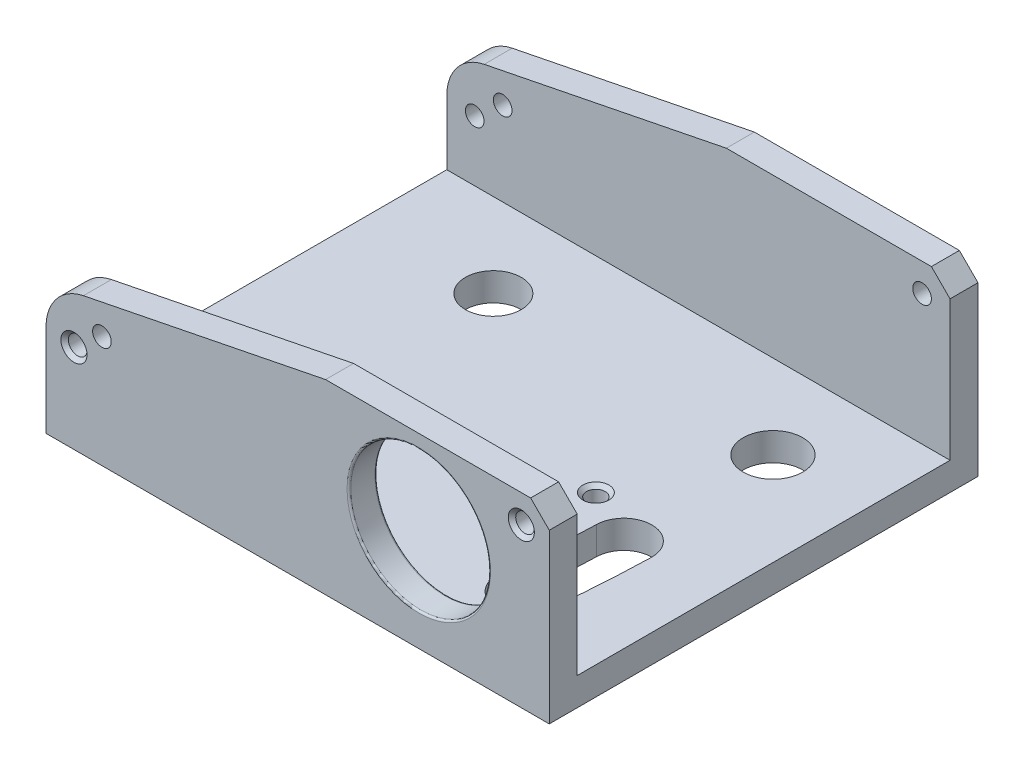
ISO-10303-21;
HEADER;
FILE_DESCRIPTION(('STEP AP214'),'2;1');
FILE_NAME('part.step','',(''),(''),'','','');
FILE_SCHEMA(('AUTOMOTIVE_DESIGN { 1 0 10303 214 1 1 1 1 }'));
ENDSEC;
DATA;
#1=APPLICATION_CONTEXT('core data for automotive mechanical design processes');
#2=APPLICATION_PROTOCOL_DEFINITION('international standard','automotive_design',2000,#1);
#3=PRODUCT_CONTEXT('',#1,'mechanical');
#4=PRODUCT('Part','Part','',(#3));
#5=PRODUCT_RELATED_PRODUCT_CATEGORY('part','',(#4));
#6=PRODUCT_DEFINITION_FORMATION('','',#4);
#7=PRODUCT_DEFINITION_CONTEXT('part definition',#1,'design');
#8=PRODUCT_DEFINITION('design','',#6,#7);
#9=PRODUCT_DEFINITION_SHAPE('','',#8);
#10=(LENGTH_UNIT() NAMED_UNIT(*) SI_UNIT(.MILLI.,.METRE.));
#11=(NAMED_UNIT(*) PLANE_ANGLE_UNIT() SI_UNIT($,.RADIAN.));
#12=(NAMED_UNIT(*) SI_UNIT($,.STERADIAN.) SOLID_ANGLE_UNIT());
#13=UNCERTAINTY_MEASURE_WITH_UNIT(LENGTH_MEASURE(1.E-05),#10,'distance_accuracy_value','');
#14=(GEOMETRIC_REPRESENTATION_CONTEXT(3) GLOBAL_UNCERTAINTY_ASSIGNED_CONTEXT((#13)) GLOBAL_UNIT_ASSIGNED_CONTEXT((#10,
#11,#12)) REPRESENTATION_CONTEXT('',''));
#15=CARTESIAN_POINT('',(0.,0.,0.));
#16=DIRECTION('',(0.,0.,1.));
#17=DIRECTION('',(1.,0.,0.));
#18=AXIS2_PLACEMENT_3D('',#15,#16,#17);
#19=CARTESIAN_POINT('',(-22.,1.5,-6.));
#20=DIRECTION('',(0.,1.,0.));
#21=DIRECTION('',(0.,0.,1.));
#22=AXIS2_PLACEMENT_3D('',#19,#20,#21);
#23=PLANE('',#22);
#24=CARTESIAN_POINT('',(-3.,1.5,6.5));
#25=DIRECTION('',(0.,1.,0.));
#26=DIRECTION('',(0.,0.,1.));
#27=AXIS2_PLACEMENT_3D('',#24,#25,#26);
#28=CIRCLE('',#27,0.700000000000007);
#29=CARTESIAN_POINT('',(-3.,1.5,7.20000000000001));
#30=VERTEX_POINT('',#29);
#31=EDGE_CURVE('E298',#30,#30,#28,.F.);
#32=ORIENTED_EDGE('',*,*,#31,.T.);
#33=EDGE_LOOP('',(#32));
#34=FACE_BOUND('',#33,.T.);
#35=CARTESIAN_POINT('',(-15.,1.5,0.));
#36=DIRECTION('',(0.,1.,0.));
#37=DIRECTION('',(0.,0.,1.));
#38=AXIS2_PLACEMENT_3D('',#35,#36,#37);
#39=CIRCLE('',#38,1.5);
#40=CARTESIAN_POINT('',(-15.,1.5,1.5));
#41=VERTEX_POINT('',#40);
#42=EDGE_CURVE('E384',#41,#41,#39,.T.);
#43=ORIENTED_EDGE('',*,*,#42,.F.);
#44=EDGE_LOOP('',(#43));
#45=FACE_BOUND('',#44,.T.);
#46=CARTESIAN_POINT('',(0.,1.5,0.));
#47=DIRECTION('',(0.,1.,0.));
#48=DIRECTION('',(0.,0.,1.));
#49=AXIS2_PLACEMENT_3D('',#46,#47,#48);
#50=CIRCLE('',#49,1.6);
#51=CARTESIAN_POINT('',(0.,1.5,1.6));
#52=VERTEX_POINT('',#51);
#53=EDGE_CURVE('E347',#52,#52,#50,.T.);
#54=ORIENTED_EDGE('',*,*,#53,.F.);
#55=EDGE_LOOP('',(#54));
#56=FACE_BOUND('',#55,.T.);
#57=CARTESIAN_POINT('',(-70.,1.5,6.));
#58=DIRECTION('',(0.,-1.,0.));
#59=DIRECTION('',(0.,0.,1.));
#60=AXIS2_PLACEMENT_3D('',#57,#58,#59);
#61=CIRCLE('',#60,68.5285656000464);
#62=CARTESIAN_POINT('',(-1.49938812969104,1.5,7.95716033915169));
#63=VERTEX_POINT('',#62);
#64=CARTESIAN_POINT('',(-1.81465725734165,1.5,12.8500611870309));
#65=VERTEX_POINT('',#64);
#66=EDGE_CURVE('E368',#63,#65,#61,.T.);
#67=ORIENTED_EDGE('',*,*,#66,.F.);
#68=CARTESIAN_POINT('',(0.,1.5,8.));
#69=DIRECTION('',(0.,1.,0.));
#70=DIRECTION('',(0.,0.,-1.));
#71=AXIS2_PLACEMENT_3D('',#68,#69,#70);
#72=CIRCLE('',#71,1.5);
#73=CARTESIAN_POINT('',(1.49938812969107,1.5,8.04283966084831));
#74=VERTEX_POINT('',#73);
#75=EDGE_CURVE('E370',#74,#63,#72,.T.);
#76=ORIENTED_EDGE('',*,*,#75,.F.);
#77=CARTESIAN_POINT('',(-70.,1.5,6.));
#78=DIRECTION('',(0.,1.,0.));
#79=DIRECTION('',(0.,0.,1.));
#80=AXIS2_PLACEMENT_3D('',#77,#78,#79);
#81=CIRCLE('',#80,71.5285656000464);
#82=CARTESIAN_POINT('',(1.17031735050041,1.5,13.1499388129691));
#83=VERTEX_POINT('',#82);
#84=EDGE_CURVE('E363',#83,#74,#81,.T.);
#85=ORIENTED_EDGE('',*,*,#84,.F.);
#86=CARTESIAN_POINT('',(-0.322169953420608,1.5,13.));
#87=DIRECTION('',(0.,1.,0.));
#88=DIRECTION('',(0.,0.,-1.));
#89=AXIS2_PLACEMENT_3D('',#86,#87,#88);
#90=CIRCLE('',#89,1.5);
#91=EDGE_CURVE('E365',#65,#83,#90,.T.);
#92=ORIENTED_EDGE('',*,*,#91,.F.);
#93=EDGE_LOOP('',(#67,#76,#85,#92));
#94=FACE_BOUND('',#93,.T.);
#95=DIRECTION('',(0.,0.,-1.));
#96=VECTOR('',#95,1.);
#97=CARTESIAN_POINT('',(5.,1.5,-6.));
#98=LINE('',#97,#96);
#99=CARTESIAN_POINT('',(5.,1.5,15.5));
#100=VERTEX_POINT('',#99);
#101=CARTESIAN_POINT('',(5.,1.5,-4.5));
#102=VERTEX_POINT('',#101);
#103=EDGE_CURVE('E226',#100,#102,#98,.T.);
#104=ORIENTED_EDGE('',*,*,#103,.T.);
#105=DIRECTION('',(-1.,0.,0.));
#106=VECTOR('',#105,1.);
#107=CARTESIAN_POINT('',(5.,1.5,-4.5));
#108=LINE('',#107,#106);
#109=CARTESIAN_POINT('',(-22.,1.5,-4.5));
#110=VERTEX_POINT('',#109);
#111=EDGE_CURVE('E180',#102,#110,#108,.T.);
#112=ORIENTED_EDGE('',*,*,#111,.T.);
#113=DIRECTION('',(0.,0.,1.));
#114=VECTOR('',#113,1.);
#115=CARTESIAN_POINT('',(-22.,1.5,-6.));
#116=LINE('',#115,#114);
#117=CARTESIAN_POINT('',(-22.,1.5,15.5));
#118=VERTEX_POINT('',#117);
#119=EDGE_CURVE('E235',#110,#118,#116,.T.);
#120=ORIENTED_EDGE('',*,*,#119,.T.);
#121=DIRECTION('',(1.,0.,0.));
#122=VECTOR('',#121,1.);
#123=CARTESIAN_POINT('',(-22.,1.5,15.5));
#124=LINE('',#123,#122);
#125=EDGE_CURVE('E221',#118,#100,#124,.T.);
#126=ORIENTED_EDGE('',*,*,#125,.T.);
#127=EDGE_LOOP('',(#104,#112,#120,#126));
#128=FACE_BOUND('',#127,.T.);
#129=ADVANCED_FACE('F30',(#34,#45,#56,#94,#128),#23,.T.);
#130=CARTESIAN_POINT('',(-22.,0.,-6.));
#131=DIRECTION('',(0.,1.,0.));
#132=DIRECTION('',(0.,0.,1.));
#133=AXIS2_PLACEMENT_3D('',#130,#131,#132);
#134=PLANE('',#133);
#135=CARTESIAN_POINT('',(-3.,0.,6.5));
#136=DIRECTION('',(0.,1.,0.));
#137=DIRECTION('',(0.,0.,1.));
#138=AXIS2_PLACEMENT_3D('',#135,#136,#137);
#139=CIRCLE('',#138,0.700000000000011);
#140=CARTESIAN_POINT('',(-3.,0.,7.20000000000001));
#141=VERTEX_POINT('',#140);
#142=EDGE_CURVE('E307',#141,#141,#139,.T.);
#143=ORIENTED_EDGE('',*,*,#142,.T.);
#144=EDGE_LOOP('',(#143));
#145=FACE_BOUND('',#144,.T.);
#146=CARTESIAN_POINT('',(-15.,0.,0.));
#147=DIRECTION('',(0.,1.,0.));
#148=DIRECTION('',(0.,0.,1.));
#149=AXIS2_PLACEMENT_3D('',#146,#147,#148);
#150=CIRCLE('',#149,1.5);
#151=CARTESIAN_POINT('',(-15.,0.,1.5));
#152=VERTEX_POINT('',#151);
#153=EDGE_CURVE('E387',#152,#152,#150,.T.);
#154=ORIENTED_EDGE('',*,*,#153,.T.);
#155=EDGE_LOOP('',(#154));
#156=FACE_BOUND('',#155,.T.);
#157=CARTESIAN_POINT('',(0.,0.,0.));
#158=DIRECTION('',(0.,1.,0.));
#159=DIRECTION('',(0.,0.,1.));
#160=AXIS2_PLACEMENT_3D('',#157,#158,#159);
#161=CIRCLE('',#160,1.6);
#162=CARTESIAN_POINT('',(0.,0.,1.6));
#163=VERTEX_POINT('',#162);
#164=EDGE_CURVE('E350',#163,#163,#161,.T.);
#165=ORIENTED_EDGE('',*,*,#164,.T.);
#166=EDGE_LOOP('',(#165));
#167=FACE_BOUND('',#166,.T.);
#168=DIRECTION('',(0.,0.,1.));
#169=VECTOR('',#168,1.);
#170=CARTESIAN_POINT('',(-22.,0.,-6.));
#171=LINE('',#170,#169);
#172=CARTESIAN_POINT('',(-22.,0.,-6.));
#173=VERTEX_POINT('',#172);
#174=CARTESIAN_POINT('',(-22.,0.,17.));
#175=VERTEX_POINT('',#174);
#176=EDGE_CURVE('E344',#173,#175,#171,.T.);
#177=ORIENTED_EDGE('',*,*,#176,.F.);
#178=DIRECTION('',(-1.,0.,0.));
#179=VECTOR('',#178,1.);
#180=CARTESIAN_POINT('',(-22.,0.,-6.));
#181=LINE('',#180,#179);
#182=CARTESIAN_POINT('',(5.,0.,-6.));
#183=VERTEX_POINT('',#182);
#184=EDGE_CURVE('E337',#183,#173,#181,.T.);
#185=ORIENTED_EDGE('',*,*,#184,.F.);
#186=DIRECTION('',(0.,0.,-1.));
#187=VECTOR('',#186,1.);
#188=CARTESIAN_POINT('',(5.,0.,-6.));
#189=LINE('',#188,#187);
#190=CARTESIAN_POINT('',(5.,0.,17.));
#191=VERTEX_POINT('',#190);
#192=EDGE_CURVE('E340',#191,#183,#189,.T.);
#193=ORIENTED_EDGE('',*,*,#192,.F.);
#194=DIRECTION('',(1.,0.,0.));
#195=VECTOR('',#194,1.);
#196=CARTESIAN_POINT('',(-22.,0.,17.));
#197=LINE('',#196,#195);
#198=EDGE_CURVE('E342',#175,#191,#197,.T.);
#199=ORIENTED_EDGE('',*,*,#198,.F.);
#200=EDGE_LOOP('',(#177,#185,#193,#199));
#201=FACE_BOUND('',#200,.T.);
#202=CARTESIAN_POINT('',(0.,0.,8.));
#203=DIRECTION('',(0.,1.,0.));
#204=DIRECTION('',(0.,0.,-1.));
#205=AXIS2_PLACEMENT_3D('',#202,#203,#204);
#206=CIRCLE('',#205,1.5);
#207=CARTESIAN_POINT('',(1.49938812969107,0.,8.04283966084831));
#208=VERTEX_POINT('',#207);
#209=CARTESIAN_POINT('',(-1.49938812969104,0.,7.95716033915169));
#210=VERTEX_POINT('',#209);
#211=EDGE_CURVE('E381',#208,#210,#206,.T.);
#212=ORIENTED_EDGE('',*,*,#211,.T.);
#213=CARTESIAN_POINT('',(-70.,0.,6.));
#214=DIRECTION('',(0.,-1.,0.));
#215=DIRECTION('',(0.,0.,1.));
#216=AXIS2_PLACEMENT_3D('',#213,#214,#215);
#217=CIRCLE('',#216,68.5285656000464);
#218=CARTESIAN_POINT('',(-1.81465725734165,0.,12.8500611870309));
#219=VERTEX_POINT('',#218);
#220=EDGE_CURVE('E378',#210,#219,#217,.T.);
#221=ORIENTED_EDGE('',*,*,#220,.T.);
#222=CARTESIAN_POINT('',(-0.322169953420608,0.,13.));
#223=DIRECTION('',(0.,1.,0.));
#224=DIRECTION('',(0.,0.,-1.));
#225=AXIS2_PLACEMENT_3D('',#222,#223,#224);
#226=CIRCLE('',#225,1.5);
#227=CARTESIAN_POINT('',(1.17031735050041,0.,13.1499388129691));
#228=VERTEX_POINT('',#227);
#229=EDGE_CURVE('E375',#219,#228,#226,.T.);
#230=ORIENTED_EDGE('',*,*,#229,.T.);
#231=CARTESIAN_POINT('',(-70.,0.,6.));
#232=DIRECTION('',(0.,1.,0.));
#233=DIRECTION('',(0.,0.,1.));
#234=AXIS2_PLACEMENT_3D('',#231,#232,#233);
#235=CIRCLE('',#234,71.5285656000464);
#236=EDGE_CURVE('E372',#228,#208,#235,.T.);
#237=ORIENTED_EDGE('',*,*,#236,.T.);
#238=EDGE_LOOP('',(#212,#221,#230,#237));
#239=FACE_BOUND('',#238,.T.);
#240=ADVANCED_FACE('F421',(#145,#156,#167,#201,#239),#134,.F.);
#241=CARTESIAN_POINT('',(-22.,1.5,-6.));
#242=DIRECTION('',(1.,0.,0.));
#243=DIRECTION('',(0.,0.,-1.));
#244=AXIS2_PLACEMENT_3D('',#241,#242,#243);
#245=PLANE('',#244);
#246=DIRECTION('',(0.,-1.,0.));
#247=VECTOR('',#246,1.);
#248=CARTESIAN_POINT('',(-22.,1.5,17.));
#249=LINE('',#248,#247);
#250=CARTESIAN_POINT('',(-22.,4.95049024320361,17.));
#251=VERTEX_POINT('',#250);
#252=EDGE_CURVE('E320',#251,#175,#249,.T.);
#253=ORIENTED_EDGE('',*,*,#252,.F.);
#254=DIRECTION('',(0.,0.,1.));
#255=VECTOR('',#254,1.);
#256=CARTESIAN_POINT('',(-22.,4.95049024320361,15.5));
#257=LINE('',#256,#255);
#258=CARTESIAN_POINT('',(-22.,4.95049024320361,15.5));
#259=VERTEX_POINT('',#258);
#260=EDGE_CURVE('E246',#251,#259,#257,.F.);
#261=ORIENTED_EDGE('',*,*,#260,.T.);
#262=DIRECTION('',(0.,-1.,0.));
#263=VECTOR('',#262,1.);
#264=CARTESIAN_POINT('',(-22.,7.,15.5));
#265=LINE('',#264,#263);
#266=EDGE_CURVE('E215',#259,#118,#265,.T.);
#267=ORIENTED_EDGE('',*,*,#266,.T.);
#268=ORIENTED_EDGE('',*,*,#119,.F.);
#269=DIRECTION('',(0.,1.,0.));
#270=VECTOR('',#269,1.);
#271=CARTESIAN_POINT('',(-22.,1.5,-4.5));
#272=LINE('',#271,#270);
#273=CARTESIAN_POINT('',(-22.,4.95049024320361,-4.5));
#274=VERTEX_POINT('',#273);
#275=EDGE_CURVE('E182',#110,#274,#272,.T.);
#276=ORIENTED_EDGE('',*,*,#275,.T.);
#277=DIRECTION('',(0.,0.,-1.));
#278=VECTOR('',#277,1.);
#279=CARTESIAN_POINT('',(-22.,4.95049024320361,-6.));
#280=LINE('',#279,#278);
#281=CARTESIAN_POINT('',(-22.,4.95049024320361,-6.));
#282=VERTEX_POINT('',#281);
#283=EDGE_CURVE('E243',#274,#282,#280,.T.);
#284=ORIENTED_EDGE('',*,*,#283,.T.);
#285=DIRECTION('',(0.,-1.,0.));
#286=VECTOR('',#285,1.);
#287=CARTESIAN_POINT('',(-22.,1.5,-6.));
#288=LINE('',#287,#286);
#289=EDGE_CURVE('E333',#282,#173,#288,.T.);
#290=ORIENTED_EDGE('',*,*,#289,.T.);
#291=ORIENTED_EDGE('',*,*,#176,.T.);
#292=EDGE_LOOP('',(#253,#261,#267,#268,#276,#284,#290,#291));
#293=FACE_BOUND('',#292,.T.);
#294=ADVANCED_FACE('F32',(#293),#245,.F.);
#295=CARTESIAN_POINT('',(-22.,1.5,17.));
#296=DIRECTION('',(0.,0.,-1.));
#297=DIRECTION('',(-1.,0.,0.));
#298=AXIS2_PLACEMENT_3D('',#295,#296,#297);
#299=PLANE('',#298);
#300=CARTESIAN_POINT('',(3.5,8.5,17.));
#301=DIRECTION('',(0.,0.,-1.));
#302=DIRECTION('',(-1.,0.,0.));
#303=AXIS2_PLACEMENT_3D('',#300,#301,#302);
#304=CIRCLE('',#303,0.700000000000003);
#305=CARTESIAN_POINT('',(2.8,8.5,17.));
#306=VERTEX_POINT('',#305);
#307=EDGE_CURVE('E275',#306,#306,#304,.T.);
#308=ORIENTED_EDGE('',*,*,#307,.T.);
#309=EDGE_LOOP('',(#308));
#310=FACE_BOUND('',#309,.T.);
#311=CARTESIAN_POINT('',(-20.5,4.75,17.));
#312=DIRECTION('',(0.,0.,-1.));
#313=DIRECTION('',(-1.,0.,0.));
#314=AXIS2_PLACEMENT_3D('',#311,#312,#313);
#315=CIRCLE('',#314,0.700000000000006);
#316=CARTESIAN_POINT('',(-21.2,4.75,17.));
#317=VERTEX_POINT('',#316);
#318=EDGE_CURVE('E280',#317,#317,#315,.T.);
#319=ORIENTED_EDGE('',*,*,#318,.T.);
#320=EDGE_LOOP('',(#319));
#321=FACE_BOUND('',#320,.T.);
#322=CARTESIAN_POINT('',(-2.,5.5,17.));
#323=DIRECTION('',(0.,0.,-1.));
#324=DIRECTION('',(-1.,0.,0.));
#325=AXIS2_PLACEMENT_3D('',#322,#323,#324);
#326=CIRCLE('',#325,3.85);
#327=CARTESIAN_POINT('',(-5.85,5.5,17.));
#328=VERTEX_POINT('',#327);
#329=EDGE_CURVE('E313',#328,#328,#326,.T.);
#330=ORIENTED_EDGE('',*,*,#329,.T.);
#331=EDGE_LOOP('',(#330));
#332=FACE_BOUND('',#331,.T.);
#333=DIRECTION('',(-0.98058067569092,-0.196116135138184,0.));
#334=VECTOR('',#333,1.);
#335=CARTESIAN_POINT('',(-7.,10.,17.));
#336=LINE('',#335,#334);
#337=CARTESIAN_POINT('',(-7.,10.,17.));
#338=VERTEX_POINT('',#337);
#339=CARTESIAN_POINT('',(-19.9902903378455,7.40194193243091,17.));
#340=VERTEX_POINT('',#339);
#341=EDGE_CURVE('E212',#338,#340,#336,.T.);
#342=ORIENTED_EDGE('',*,*,#341,.T.);
#343=CARTESIAN_POINT('',(-19.5,4.95049024320361,17.));
#344=DIRECTION('',(0.,0.,-1.));
#345=DIRECTION('',(-1.,0.,0.));
#346=AXIS2_PLACEMENT_3D('',#343,#344,#345);
#347=CIRCLE('',#346,2.5);
#348=EDGE_CURVE('E241',#340,#251,#347,.F.);
#349=ORIENTED_EDGE('',*,*,#348,.T.);
#350=ORIENTED_EDGE('',*,*,#252,.T.);
#351=ORIENTED_EDGE('',*,*,#198,.T.);
#352=DIRECTION('',(0.,-1.,0.));
#353=VECTOR('',#352,1.);
#354=CARTESIAN_POINT('',(5.,1.5,17.));
#355=LINE('',#354,#353);
#356=CARTESIAN_POINT('',(5.,9.,17.));
#357=VERTEX_POINT('',#356);
#358=EDGE_CURVE('E323',#357,#191,#355,.T.);
#359=ORIENTED_EDGE('',*,*,#358,.F.);
#360=DIRECTION('',(-0.707106781186548,0.707106781186547,0.));
#361=VECTOR('',#360,1.);
#362=CARTESIAN_POINT('',(5.,9.,17.));
#363=LINE('',#362,#361);
#364=CARTESIAN_POINT('',(4.,10.,17.));
#365=VERTEX_POINT('',#364);
#366=EDGE_CURVE('E206',#357,#365,#363,.T.);
#367=ORIENTED_EDGE('',*,*,#366,.T.);
#368=DIRECTION('',(-1.,0.,0.));
#369=VECTOR('',#368,1.);
#370=CARTESIAN_POINT('',(4.,10.,17.));
#371=LINE('',#370,#369);
#372=EDGE_CURVE('E209',#365,#338,#371,.T.);
#373=ORIENTED_EDGE('',*,*,#372,.T.);
#374=EDGE_LOOP('',(#342,#349,#350,#351,#359,#367,#373));
#375=FACE_BOUND('',#374,.T.);
#376=CARTESIAN_POINT('',(-19.,6.,17.));
#377=DIRECTION('',(0.,0.,1.));
#378=DIRECTION('',(1.,0.,0.));
#379=AXIS2_PLACEMENT_3D('',#376,#377,#378);
#380=CIRCLE('',#379,0.499999999999999);
#381=CARTESIAN_POINT('',(-18.5,6.,17.));
#382=VERTEX_POINT('',#381);
#383=EDGE_CURVE('E193',#382,#382,#380,.T.);
#384=ORIENTED_EDGE('',*,*,#383,.F.);
#385=EDGE_LOOP('',(#384));
#386=FACE_BOUND('',#385,.T.);
#387=ADVANCED_FACE('F423',(#310,#321,#332,#375,#386),#299,.F.);
#388=CARTESIAN_POINT('',(5.,1.5,-6.));
#389=DIRECTION('',(-1.,0.,0.));
#390=DIRECTION('',(0.,0.,1.));
#391=AXIS2_PLACEMENT_3D('',#388,#389,#390);
#392=PLANE('',#391);
#393=ORIENTED_EDGE('',*,*,#192,.T.);
#394=DIRECTION('',(0.,-1.,0.));
#395=VECTOR('',#394,1.);
#396=CARTESIAN_POINT('',(5.,1.5,-6.));
#397=LINE('',#396,#395);
#398=CARTESIAN_POINT('',(5.,9.,-6.));
#399=VERTEX_POINT('',#398);
#400=EDGE_CURVE('E328',#399,#183,#397,.T.);
#401=ORIENTED_EDGE('',*,*,#400,.F.);
#402=DIRECTION('',(0.,0.,-1.));
#403=VECTOR('',#402,1.);
#404=CARTESIAN_POINT('',(5.,9.,-4.5));
#405=LINE('',#404,#403);
#406=CARTESIAN_POINT('',(5.,9.,-4.5));
#407=VERTEX_POINT('',#406);
#408=EDGE_CURVE('E190',#407,#399,#405,.T.);
#409=ORIENTED_EDGE('',*,*,#408,.F.);
#410=DIRECTION('',(0.,-1.,0.));
#411=VECTOR('',#410,1.);
#412=CARTESIAN_POINT('',(5.,9.,-4.5));
#413=LINE('',#412,#411);
#414=EDGE_CURVE('E174',#407,#102,#413,.T.);
#415=ORIENTED_EDGE('',*,*,#414,.T.);
#416=ORIENTED_EDGE('',*,*,#103,.F.);
#417=DIRECTION('',(0.,1.,0.));
#418=VECTOR('',#417,1.);
#419=CARTESIAN_POINT('',(5.00000000000001,1.5,15.5));
#420=LINE('',#419,#418);
#421=CARTESIAN_POINT('',(5.,9.,15.5));
#422=VERTEX_POINT('',#421);
#423=EDGE_CURVE('E225',#100,#422,#420,.T.);
#424=ORIENTED_EDGE('',*,*,#423,.T.);
#425=DIRECTION('',(0.,0.,1.));
#426=VECTOR('',#425,1.);
#427=CARTESIAN_POINT('',(5.,9.,15.5));
#428=LINE('',#427,#426);
#429=EDGE_CURVE('E269',#422,#357,#428,.T.);
#430=ORIENTED_EDGE('',*,*,#429,.T.);
#431=ORIENTED_EDGE('',*,*,#358,.T.);
#432=EDGE_LOOP('',(#393,#401,#409,#415,#416,#424,#430,#431));
#433=FACE_BOUND('',#432,.T.);
#434=ADVANCED_FACE('F403',(#433),#392,.F.);
#435=CARTESIAN_POINT('',(-22.,1.5,-6.));
#436=DIRECTION('',(0.,0.,1.));
#437=DIRECTION('',(1.,0.,0.));
#438=AXIS2_PLACEMENT_3D('',#435,#436,#437);
#439=PLANE('',#438);
#440=CARTESIAN_POINT('',(-20.5,4.75,-6.));
#441=DIRECTION('',(0.,0.,1.));
#442=DIRECTION('',(1.,0.,0.));
#443=AXIS2_PLACEMENT_3D('',#440,#441,#442);
#444=CIRCLE('',#443,0.699999999999996);
#445=CARTESIAN_POINT('',(-19.8,4.75,-6.));
#446=VERTEX_POINT('',#445);
#447=EDGE_CURVE('E289',#446,#446,#444,.T.);
#448=ORIENTED_EDGE('',*,*,#447,.T.);
#449=EDGE_LOOP('',(#448));
#450=FACE_BOUND('',#449,.T.);
#451=CARTESIAN_POINT('',(3.5,8.5,-6.));
#452=DIRECTION('',(0.,0.,1.));
#453=DIRECTION('',(1.,0.,0.));
#454=AXIS2_PLACEMENT_3D('',#451,#452,#453);
#455=CIRCLE('',#454,0.700000000000006);
#456=CARTESIAN_POINT('',(4.20000000000001,8.5,-6.));
#457=VERTEX_POINT('',#456);
#458=EDGE_CURVE('E292',#457,#457,#455,.T.);
#459=ORIENTED_EDGE('',*,*,#458,.T.);
#460=EDGE_LOOP('',(#459));
#461=FACE_BOUND('',#460,.T.);
#462=ORIENTED_EDGE('',*,*,#289,.F.);
#463=CARTESIAN_POINT('',(-19.5,4.95049024320361,-6.));
#464=DIRECTION('',(0.,0.,1.));
#465=DIRECTION('',(1.,0.,0.));
#466=AXIS2_PLACEMENT_3D('',#463,#464,#465);
#467=CIRCLE('',#466,2.5);
#468=CARTESIAN_POINT('',(-19.9902903378455,7.40194193243091,-6.));
#469=VERTEX_POINT('',#468);
#470=EDGE_CURVE('E52',#282,#469,#467,.F.);
#471=ORIENTED_EDGE('',*,*,#470,.T.);
#472=DIRECTION('',(0.98058067569092,0.196116135138184,0.));
#473=VECTOR('',#472,1.);
#474=CARTESIAN_POINT('',(-22.,7.,-6.));
#475=LINE('',#474,#473);
#476=CARTESIAN_POINT('',(-7.,10.,-6.));
#477=VERTEX_POINT('',#476);
#478=EDGE_CURVE('E151',#469,#477,#475,.T.);
#479=ORIENTED_EDGE('',*,*,#478,.T.);
#480=DIRECTION('',(1.,0.,0.));
#481=VECTOR('',#480,1.);
#482=CARTESIAN_POINT('',(-7.,10.,-6.));
#483=LINE('',#482,#481);
#484=CARTESIAN_POINT('',(4.,10.,-6.));
#485=VERTEX_POINT('',#484);
#486=EDGE_CURVE('E157',#477,#485,#483,.T.);
#487=ORIENTED_EDGE('',*,*,#486,.T.);
#488=DIRECTION('',(0.707106781186548,-0.707106781186547,0.));
#489=VECTOR('',#488,1.);
#490=CARTESIAN_POINT('',(4.,10.,-6.));
#491=LINE('',#490,#489);
#492=EDGE_CURVE('E172',#485,#399,#491,.T.);
#493=ORIENTED_EDGE('',*,*,#492,.T.);
#494=ORIENTED_EDGE('',*,*,#400,.T.);
#495=ORIENTED_EDGE('',*,*,#184,.T.);
#496=EDGE_LOOP('',(#462,#471,#479,#487,#493,#494,#495));
#497=FACE_BOUND('',#496,.T.);
#498=CARTESIAN_POINT('',(-19.,6.,-6.));
#499=DIRECTION('',(0.,0.,-1.));
#500=DIRECTION('',(-1.,0.,0.));
#501=AXIS2_PLACEMENT_3D('',#498,#499,#500);
#502=CIRCLE('',#501,0.499999999999999);
#503=CARTESIAN_POINT('',(-19.5,6.,-6.));
#504=VERTEX_POINT('',#503);
#505=EDGE_CURVE('E762',#504,#504,#502,.T.);
#506=ORIENTED_EDGE('',*,*,#505,.F.);
#507=EDGE_LOOP('',(#506));
#508=FACE_BOUND('',#507,.T.);
#509=ADVANCED_FACE('F153',(#450,#461,#497,#508),#439,.F.);
#510=CARTESIAN_POINT('',(0.,1.5,0.));
#511=DIRECTION('',(0.,-1.,0.));
#512=DIRECTION('',(0.,0.,-1.));
#513=AXIS2_PLACEMENT_3D('',#510,#511,#512);
#514=CYLINDRICAL_SURFACE('',#513,1.6);
#515=ORIENTED_EDGE('',*,*,#53,.T.);
#516=EDGE_LOOP('',(#515));
#517=FACE_BOUND('',#516,.T.);
#518=ORIENTED_EDGE('',*,*,#164,.F.);
#519=EDGE_LOOP('',(#518));
#520=FACE_BOUND('',#519,.T.);
#521=ADVANCED_FACE('F453',(#517,#520),#514,.F.);
#522=CARTESIAN_POINT('',(0.,1.5,8.));
#523=DIRECTION('',(0.,-1.,0.));
#524=DIRECTION('',(0.,0.,-1.));
#525=AXIS2_PLACEMENT_3D('',#522,#523,#524);
#526=CYLINDRICAL_SURFACE('',#525,1.5);
#527=ORIENTED_EDGE('',*,*,#211,.F.);
#528=DIRECTION('',(0.,-1.,0.));
#529=VECTOR('',#528,1.);
#530=CARTESIAN_POINT('',(1.49938812969107,1.5,8.04283966084831));
#531=LINE('',#530,#529);
#532=EDGE_CURVE('E360',#74,#208,#531,.T.);
#533=ORIENTED_EDGE('',*,*,#532,.F.);
#534=ORIENTED_EDGE('',*,*,#75,.T.);
#535=DIRECTION('',(0.,-1.,0.));
#536=VECTOR('',#535,1.);
#537=CARTESIAN_POINT('',(-1.49938812969104,1.5,7.95716033915169));
#538=LINE('',#537,#536);
#539=EDGE_CURVE('E353',#63,#210,#538,.T.);
#540=ORIENTED_EDGE('',*,*,#539,.T.);
#541=EDGE_LOOP('',(#527,#533,#534,#540));
#542=FACE_BOUND('',#541,.T.);
#543=ADVANCED_FACE('F517',(#542),#526,.F.);
#544=CARTESIAN_POINT('',(-70.,1.5,6.));
#545=DIRECTION('',(0.,-1.,0.));
#546=DIRECTION('',(0.,0.,-1.));
#547=AXIS2_PLACEMENT_3D('',#544,#545,#546);
#548=CYLINDRICAL_SURFACE('',#547,68.5285656000464);
#549=ORIENTED_EDGE('',*,*,#220,.F.);
#550=ORIENTED_EDGE('',*,*,#539,.F.);
#551=ORIENTED_EDGE('',*,*,#66,.T.);
#552=DIRECTION('',(0.,-1.,0.));
#553=VECTOR('',#552,1.);
#554=CARTESIAN_POINT('',(-1.81465725734165,1.5,12.8500611870309));
#555=LINE('',#554,#553);
#556=EDGE_CURVE('E356',#65,#219,#555,.T.);
#557=ORIENTED_EDGE('',*,*,#556,.T.);
#558=EDGE_LOOP('',(#549,#550,#551,#557));
#559=FACE_BOUND('',#558,.T.);
#560=ADVANCED_FACE('F513',(#559),#548,.T.);
#561=CARTESIAN_POINT('',(-0.322169953420608,1.5,13.));
#562=DIRECTION('',(0.,-1.,0.));
#563=DIRECTION('',(0.,0.,-1.));
#564=AXIS2_PLACEMENT_3D('',#561,#562,#563);
#565=CYLINDRICAL_SURFACE('',#564,1.5);
#566=ORIENTED_EDGE('',*,*,#229,.F.);
#567=ORIENTED_EDGE('',*,*,#556,.F.);
#568=ORIENTED_EDGE('',*,*,#91,.T.);
#569=DIRECTION('',(0.,-1.,0.));
#570=VECTOR('',#569,1.);
#571=CARTESIAN_POINT('',(1.17031735050041,1.5,13.1499388129691));
#572=LINE('',#571,#570);
#573=EDGE_CURVE('E358',#83,#228,#572,.T.);
#574=ORIENTED_EDGE('',*,*,#573,.T.);
#575=EDGE_LOOP('',(#566,#567,#568,#574));
#576=FACE_BOUND('',#575,.T.);
#577=ADVANCED_FACE('F509',(#576),#565,.F.);
#578=CARTESIAN_POINT('',(-70.,1.5,6.));
#579=DIRECTION('',(0.,-1.,0.));
#580=DIRECTION('',(0.,0.,-1.));
#581=AXIS2_PLACEMENT_3D('',#578,#579,#580);
#582=CYLINDRICAL_SURFACE('',#581,71.5285656000464);
#583=ORIENTED_EDGE('',*,*,#236,.F.);
#584=ORIENTED_EDGE('',*,*,#573,.F.);
#585=ORIENTED_EDGE('',*,*,#84,.T.);
#586=ORIENTED_EDGE('',*,*,#532,.T.);
#587=EDGE_LOOP('',(#583,#584,#585,#586));
#588=FACE_BOUND('',#587,.T.);
#589=ADVANCED_FACE('F505',(#588),#582,.F.);
#590=CARTESIAN_POINT('',(-15.,1.5,0.));
#591=DIRECTION('',(0.,-1.,0.));
#592=DIRECTION('',(0.,0.,-1.));
#593=AXIS2_PLACEMENT_3D('',#590,#591,#592);
#594=CYLINDRICAL_SURFACE('',#593,1.5);
#595=ORIENTED_EDGE('',*,*,#42,.T.);
#596=EDGE_LOOP('',(#595));
#597=FACE_BOUND('',#596,.T.);
#598=ORIENTED_EDGE('',*,*,#153,.F.);
#599=EDGE_LOOP('',(#598));
#600=FACE_BOUND('',#599,.T.);
#601=ADVANCED_FACE('F501',(#597,#600),#594,.F.);
#602=CARTESIAN_POINT('',(-3.,1.5,6.5));
#603=DIRECTION('',(0.,-1.,0.));
#604=DIRECTION('',(0.,0.,-1.));
#605=AXIS2_PLACEMENT_3D('',#602,#603,#604);
#606=CYLINDRICAL_SURFACE('',#605,0.500000000000001);
#607=CARTESIAN_POINT('',(-3.,0.200000000000013,6.5));
#608=DIRECTION('',(0.,1.,0.));
#609=DIRECTION('',(0.,0.,1.));
#610=AXIS2_PLACEMENT_3D('',#607,#608,#609);
#611=CIRCLE('',#610,0.500000000000001);
#612=CARTESIAN_POINT('',(-3.,0.200000000000013,7.));
#613=VERTEX_POINT('',#612);
#614=EDGE_CURVE('E301',#613,#613,#611,.F.);
#615=ORIENTED_EDGE('',*,*,#614,.T.);
#616=EDGE_LOOP('',(#615));
#617=FACE_BOUND('',#616,.T.);
#618=CARTESIAN_POINT('',(-3.,1.3,6.5));
#619=DIRECTION('',(0.,1.,0.));
#620=DIRECTION('',(0.,0.,1.));
#621=AXIS2_PLACEMENT_3D('',#618,#619,#620);
#622=CIRCLE('',#621,0.500000000000001);
#623=CARTESIAN_POINT('',(-3.,1.3,7.));
#624=VERTEX_POINT('',#623);
#625=EDGE_CURVE('E304',#624,#624,#622,.T.);
#626=ORIENTED_EDGE('',*,*,#625,.T.);
#627=EDGE_LOOP('',(#626));
#628=FACE_BOUND('',#627,.T.);
#629=ADVANCED_FACE('F494',(#617,#628),#606,.F.);
#630=CARTESIAN_POINT('',(-7.,10.,15.5));
#631=DIRECTION('',(-0.196116135138184,0.98058067569092,0.));
#632=DIRECTION('',(-0.98058067569092,-0.196116135138184,0.));
#633=AXIS2_PLACEMENT_3D('',#630,#631,#632);
#634=PLANE('',#633);
#635=DIRECTION('',(-0.98058067569092,-0.196116135138184,0.));
#636=VECTOR('',#635,1.);
#637=CARTESIAN_POINT('',(-7.,10.,15.5));
#638=LINE('',#637,#636);
#639=CARTESIAN_POINT('',(-7.,10.,15.5));
#640=VERTEX_POINT('',#639);
#641=CARTESIAN_POINT('',(-19.9902903378455,7.40194193243091,15.5));
#642=VERTEX_POINT('',#641);
#643=EDGE_CURVE('E257',#640,#642,#638,.T.);
#644=ORIENTED_EDGE('',*,*,#643,.T.);
#645=DIRECTION('',(0.,0.,1.));
#646=VECTOR('',#645,1.);
#647=CARTESIAN_POINT('',(-19.9902903378455,7.40194193243091,17.));
#648=LINE('',#647,#646);
#649=EDGE_CURVE('E266',#642,#340,#648,.T.);
#650=ORIENTED_EDGE('',*,*,#649,.T.);
#651=ORIENTED_EDGE('',*,*,#341,.F.);
#652=DIRECTION('',(0.,0.,1.));
#653=VECTOR('',#652,1.);
#654=CARTESIAN_POINT('',(-7.,10.,15.5));
#655=LINE('',#654,#653);
#656=EDGE_CURVE('E267',#640,#338,#655,.T.);
#657=ORIENTED_EDGE('',*,*,#656,.F.);
#658=EDGE_LOOP('',(#644,#650,#651,#657));
#659=FACE_BOUND('',#658,.T.);
#660=ADVANCED_FACE('F264',(#659),#634,.T.);
#661=CARTESIAN_POINT('',(4.,10.,15.5));
#662=DIRECTION('',(0.,1.,0.));
#663=DIRECTION('',(-1.,0.,0.));
#664=AXIS2_PLACEMENT_3D('',#661,#662,#663);
#665=PLANE('',#664);
#666=ORIENTED_EDGE('',*,*,#372,.F.);
#667=DIRECTION('',(0.,0.,1.));
#668=VECTOR('',#667,1.);
#669=CARTESIAN_POINT('',(4.,10.,15.5));
#670=LINE('',#669,#668);
#671=CARTESIAN_POINT('',(4.,10.,15.5));
#672=VERTEX_POINT('',#671);
#673=EDGE_CURVE('E392',#672,#365,#670,.T.);
#674=ORIENTED_EDGE('',*,*,#673,.F.);
#675=DIRECTION('',(-1.,0.,0.));
#676=VECTOR('',#675,1.);
#677=CARTESIAN_POINT('',(4.,10.,15.5));
#678=LINE('',#677,#676);
#679=EDGE_CURVE('E270',#672,#640,#678,.T.);
#680=ORIENTED_EDGE('',*,*,#679,.T.);
#681=ORIENTED_EDGE('',*,*,#656,.T.);
#682=EDGE_LOOP('',(#666,#674,#680,#681));
#683=FACE_BOUND('',#682,.T.);
#684=ADVANCED_FACE('F493',(#683),#665,.T.);
#685=CARTESIAN_POINT('',(5.,9.,15.5));
#686=DIRECTION('',(0.707106781186547,0.707106781186548,0.));
#687=DIRECTION('',(-0.707106781186548,0.707106781186547,0.));
#688=AXIS2_PLACEMENT_3D('',#685,#686,#687);
#689=PLANE('',#688);
#690=ORIENTED_EDGE('',*,*,#366,.F.);
#691=ORIENTED_EDGE('',*,*,#429,.F.);
#692=DIRECTION('',(-0.707106781186548,0.707106781186547,0.));
#693=VECTOR('',#692,1.);
#694=CARTESIAN_POINT('',(5.,9.,15.5));
#695=LINE('',#694,#693);
#696=EDGE_CURVE('E218',#422,#672,#695,.T.);
#697=ORIENTED_EDGE('',*,*,#696,.T.);
#698=ORIENTED_EDGE('',*,*,#673,.T.);
#699=EDGE_LOOP('',(#690,#691,#697,#698));
#700=FACE_BOUND('',#699,.T.);
#701=ADVANCED_FACE('F399',(#700),#689,.T.);
#702=CARTESIAN_POINT('',(-22.,1.5,15.5));
#703=DIRECTION('',(0.,0.,1.));
#704=DIRECTION('',(1.,0.,0.));
#705=AXIS2_PLACEMENT_3D('',#702,#703,#704);
#706=PLANE('',#705);
#707=CARTESIAN_POINT('',(-2.,5.5,15.5));
#708=DIRECTION('',(0.,0.,1.));
#709=DIRECTION('',(1.,0.,0.));
#710=AXIS2_PLACEMENT_3D('',#707,#708,#709);
#711=CIRCLE('',#710,3.85);
#712=CARTESIAN_POINT('',(1.85,5.5,15.5));
#713=VERTEX_POINT('',#712);
#714=EDGE_CURVE('E310',#713,#713,#711,.T.);
#715=ORIENTED_EDGE('',*,*,#714,.T.);
#716=EDGE_LOOP('',(#715));
#717=FACE_BOUND('',#716,.T.);
#718=CARTESIAN_POINT('',(-19.,6.,15.5));
#719=DIRECTION('',(0.,0.,1.));
#720=DIRECTION('',(1.,0.,0.));
#721=AXIS2_PLACEMENT_3D('',#718,#719,#720);
#722=CIRCLE('',#721,0.499999999999999);
#723=CARTESIAN_POINT('',(-18.5,6.,15.5));
#724=VERTEX_POINT('',#723);
#725=EDGE_CURVE('E197',#724,#724,#722,.T.);
#726=ORIENTED_EDGE('',*,*,#725,.T.);
#727=EDGE_LOOP('',(#726));
#728=FACE_BOUND('',#727,.T.);
#729=CARTESIAN_POINT('',(-20.5,4.75,15.5));
#730=DIRECTION('',(0.,0.,1.));
#731=DIRECTION('',(1.,0.,0.));
#732=AXIS2_PLACEMENT_3D('',#729,#730,#731);
#733=CIRCLE('',#732,0.499999999999999);
#734=CARTESIAN_POINT('',(-20.,4.75,15.5));
#735=VERTEX_POINT('',#734);
#736=EDGE_CURVE('E200',#735,#735,#733,.T.);
#737=ORIENTED_EDGE('',*,*,#736,.T.);
#738=EDGE_LOOP('',(#737));
#739=FACE_BOUND('',#738,.T.);
#740=CARTESIAN_POINT('',(3.5,8.5,15.5));
#741=DIRECTION('',(0.,0.,1.));
#742=DIRECTION('',(1.,0.,0.));
#743=AXIS2_PLACEMENT_3D('',#740,#741,#742);
#744=CIRCLE('',#743,0.500000000000003);
#745=CARTESIAN_POINT('',(4.,8.5,15.5));
#746=VERTEX_POINT('',#745);
#747=EDGE_CURVE('E203',#746,#746,#744,.T.);
#748=ORIENTED_EDGE('',*,*,#747,.T.);
#749=EDGE_LOOP('',(#748));
#750=FACE_BOUND('',#749,.T.);
#751=ORIENTED_EDGE('',*,*,#266,.F.);
#752=CARTESIAN_POINT('',(-19.5,4.95049024320361,15.5));
#753=DIRECTION('',(0.,0.,1.));
#754=DIRECTION('',(1.,0.,0.));
#755=AXIS2_PLACEMENT_3D('',#752,#753,#754);
#756=CIRCLE('',#755,2.5);
#757=EDGE_CURVE('E248',#259,#642,#756,.F.);
#758=ORIENTED_EDGE('',*,*,#757,.T.);
#759=ORIENTED_EDGE('',*,*,#643,.F.);
#760=ORIENTED_EDGE('',*,*,#679,.F.);
#761=ORIENTED_EDGE('',*,*,#696,.F.);
#762=ORIENTED_EDGE('',*,*,#423,.F.);
#763=ORIENTED_EDGE('',*,*,#125,.F.);
#764=EDGE_LOOP('',(#751,#758,#759,#760,#761,#762,#763));
#765=FACE_BOUND('',#764,.T.);
#766=ADVANCED_FACE('F255',(#717,#728,#739,#750,#765),#706,.F.);
#767=CARTESIAN_POINT('',(3.5,8.5,15.5));
#768=DIRECTION('',(0.,0.,1.));
#769=DIRECTION('',(1.,0.,0.));
#770=AXIS2_PLACEMENT_3D('',#767,#768,#769);
#771=CYLINDRICAL_SURFACE('',#770,0.500000000000003);
#772=CARTESIAN_POINT('',(3.5,8.5,16.8));
#773=DIRECTION('',(0.,0.,-1.));
#774=DIRECTION('',(-1.,0.,0.));
#775=AXIS2_PLACEMENT_3D('',#772,#773,#774);
#776=CIRCLE('',#775,0.500000000000003);
#777=CARTESIAN_POINT('',(3.,8.5,16.8));
#778=VERTEX_POINT('',#777);
#779=EDGE_CURVE('E283',#778,#778,#776,.F.);
#780=ORIENTED_EDGE('',*,*,#779,.T.);
#781=EDGE_LOOP('',(#780));
#782=FACE_BOUND('',#781,.T.);
#783=ORIENTED_EDGE('',*,*,#747,.F.);
#784=EDGE_LOOP('',(#783));
#785=FACE_BOUND('',#784,.T.);
#786=ADVANCED_FACE('F477',(#782,#785),#771,.F.);
#787=CARTESIAN_POINT('',(-2.,5.5,15.5));
#788=DIRECTION('',(0.,0.,1.));
#789=DIRECTION('',(1.,0.,0.));
#790=AXIS2_PLACEMENT_3D('',#787,#788,#789);
#791=CYLINDRICAL_SURFACE('',#790,3.75);
#792=CARTESIAN_POINT('',(-2.,5.5,16.9));
#793=DIRECTION('',(0.,0.,-1.));
#794=DIRECTION('',(-1.,0.,0.));
#795=AXIS2_PLACEMENT_3D('',#792,#793,#794);
#796=CIRCLE('',#795,3.75);
#797=CARTESIAN_POINT('',(-5.75,5.5,16.9));
#798=VERTEX_POINT('',#797);
#799=EDGE_CURVE('E316',#798,#798,#796,.F.);
#800=ORIENTED_EDGE('',*,*,#799,.T.);
#801=EDGE_LOOP('',(#800));
#802=FACE_BOUND('',#801,.T.);
#803=CARTESIAN_POINT('',(-2.,5.5,15.6));
#804=DIRECTION('',(0.,0.,1.));
#805=DIRECTION('',(1.,0.,0.));
#806=AXIS2_PLACEMENT_3D('',#803,#804,#805);
#807=CIRCLE('',#806,3.75);
#808=CARTESIAN_POINT('',(1.75,5.5,15.6));
#809=VERTEX_POINT('',#808);
#810=EDGE_CURVE('E318',#809,#809,#807,.F.);
#811=ORIENTED_EDGE('',*,*,#810,.T.);
#812=EDGE_LOOP('',(#811));
#813=FACE_BOUND('',#812,.T.);
#814=ADVANCED_FACE('F475',(#802,#813),#791,.F.);
#815=CARTESIAN_POINT('',(-20.5,4.75,15.5));
#816=DIRECTION('',(0.,0.,1.));
#817=DIRECTION('',(1.,0.,0.));
#818=AXIS2_PLACEMENT_3D('',#815,#816,#817);
#819=CYLINDRICAL_SURFACE('',#818,0.499999999999999);
#820=CARTESIAN_POINT('',(-20.5,4.75,16.8));
#821=DIRECTION('',(0.,0.,-1.));
#822=DIRECTION('',(-1.,0.,0.));
#823=AXIS2_PLACEMENT_3D('',#820,#821,#822);
#824=CIRCLE('',#823,0.499999999999999);
#825=CARTESIAN_POINT('',(-21.,4.75,16.8));
#826=VERTEX_POINT('',#825);
#827=EDGE_CURVE('E273',#826,#826,#824,.F.);
#828=ORIENTED_EDGE('',*,*,#827,.T.);
#829=EDGE_LOOP('',(#828));
#830=FACE_BOUND('',#829,.T.);
#831=ORIENTED_EDGE('',*,*,#736,.F.);
#832=EDGE_LOOP('',(#831));
#833=FACE_BOUND('',#832,.T.);
#834=ADVANCED_FACE('F436',(#830,#833),#819,.F.);
#835=CARTESIAN_POINT('',(-19.,6.,15.5));
#836=DIRECTION('',(0.,0.,1.));
#837=DIRECTION('',(1.,0.,0.));
#838=AXIS2_PLACEMENT_3D('',#835,#836,#837);
#839=CYLINDRICAL_SURFACE('',#838,0.499999999999999);
#840=ORIENTED_EDGE('',*,*,#725,.F.);
#841=EDGE_LOOP('',(#840));
#842=FACE_BOUND('',#841,.T.);
#843=ORIENTED_EDGE('',*,*,#383,.T.);
#844=EDGE_LOOP('',(#843));
#845=FACE_BOUND('',#844,.T.);
#846=ADVANCED_FACE('F429',(#842,#845),#839,.F.);
#847=CARTESIAN_POINT('',(4.,10.,-4.5));
#848=DIRECTION('',(0.707106781186547,0.707106781186548,0.));
#849=DIRECTION('',(-0.707106781186548,0.707106781186547,0.));
#850=AXIS2_PLACEMENT_3D('',#847,#848,#849);
#851=PLANE('',#850);
#852=ORIENTED_EDGE('',*,*,#492,.F.);
#853=DIRECTION('',(0.,0.,-1.));
#854=VECTOR('',#853,1.);
#855=CARTESIAN_POINT('',(4.,10.,-4.5));
#856=LINE('',#855,#854);
#857=CARTESIAN_POINT('',(4.,10.,-4.5));
#858=VERTEX_POINT('',#857);
#859=EDGE_CURVE('E168',#858,#485,#856,.T.);
#860=ORIENTED_EDGE('',*,*,#859,.F.);
#861=DIRECTION('',(0.707106781186548,-0.707106781186547,0.));
#862=VECTOR('',#861,1.);
#863=CARTESIAN_POINT('',(4.,10.,-4.5));
#864=LINE('',#863,#862);
#865=EDGE_CURVE('E169',#858,#407,#864,.T.);
#866=ORIENTED_EDGE('',*,*,#865,.T.);
#867=ORIENTED_EDGE('',*,*,#408,.T.);
#868=EDGE_LOOP('',(#852,#860,#866,#867));
#869=FACE_BOUND('',#868,.T.);
#870=ADVANCED_FACE('F426',(#869),#851,.T.);
#871=CARTESIAN_POINT('',(-7.,10.,-4.5));
#872=DIRECTION('',(0.,1.,0.));
#873=DIRECTION('',(-1.,0.,0.));
#874=AXIS2_PLACEMENT_3D('',#871,#872,#873);
#875=PLANE('',#874);
#876=ORIENTED_EDGE('',*,*,#486,.F.);
#877=DIRECTION('',(0.,0.,-1.));
#878=VECTOR('',#877,1.);
#879=CARTESIAN_POINT('',(-7.,10.,-4.5));
#880=LINE('',#879,#878);
#881=CARTESIAN_POINT('',(-7.,10.,-4.5));
#882=VERTEX_POINT('',#881);
#883=EDGE_CURVE('E162',#882,#477,#880,.T.);
#884=ORIENTED_EDGE('',*,*,#883,.F.);
#885=DIRECTION('',(1.,0.,0.));
#886=VECTOR('',#885,1.);
#887=CARTESIAN_POINT('',(-7.,10.,-4.5));
#888=LINE('',#887,#886);
#889=EDGE_CURVE('E186',#882,#858,#888,.T.);
#890=ORIENTED_EDGE('',*,*,#889,.T.);
#891=ORIENTED_EDGE('',*,*,#859,.T.);
#892=EDGE_LOOP('',(#876,#884,#890,#891));
#893=FACE_BOUND('',#892,.T.);
#894=ADVANCED_FACE('F171',(#893),#875,.T.);
#895=CARTESIAN_POINT('',(-22.,7.,-4.5));
#896=DIRECTION('',(-0.196116135138184,0.98058067569092,0.));
#897=DIRECTION('',(-0.98058067569092,-0.196116135138184,0.));
#898=AXIS2_PLACEMENT_3D('',#895,#896,#897);
#899=PLANE('',#898);
#900=ORIENTED_EDGE('',*,*,#478,.F.);
#901=DIRECTION('',(0.,0.,-1.));
#902=VECTOR('',#901,1.);
#903=CARTESIAN_POINT('',(-19.9902903378455,7.40194193243091,-4.5));
#904=LINE('',#903,#902);
#905=CARTESIAN_POINT('',(-19.9902903378455,7.40194193243091,-4.5));
#906=VERTEX_POINT('',#905);
#907=EDGE_CURVE('E38',#469,#906,#904,.F.);
#908=ORIENTED_EDGE('',*,*,#907,.T.);
#909=DIRECTION('',(0.98058067569092,0.196116135138184,0.));
#910=VECTOR('',#909,1.);
#911=CARTESIAN_POINT('',(-22.,7.,-4.5));
#912=LINE('',#911,#910);
#913=EDGE_CURVE('E164',#906,#882,#912,.T.);
#914=ORIENTED_EDGE('',*,*,#913,.T.);
#915=ORIENTED_EDGE('',*,*,#883,.T.);
#916=EDGE_LOOP('',(#900,#908,#914,#915));
#917=FACE_BOUND('',#916,.T.);
#918=ADVANCED_FACE('F163',(#917),#899,.T.);
#919=CARTESIAN_POINT('',(5.,1.5,-4.5));
#920=DIRECTION('',(0.,0.,-1.));
#921=DIRECTION('',(-1.,0.,0.));
#922=AXIS2_PLACEMENT_3D('',#919,#920,#921);
#923=PLANE('',#922);
#924=CARTESIAN_POINT('',(-19.,6.,-4.5));
#925=DIRECTION('',(0.,0.,-1.));
#926=DIRECTION('',(-1.,0.,0.));
#927=AXIS2_PLACEMENT_3D('',#924,#925,#926);
#928=CIRCLE('',#927,0.499999999999999);
#929=CARTESIAN_POINT('',(-19.5,6.,-4.5));
#930=VERTEX_POINT('',#929);
#931=EDGE_CURVE('E759',#930,#930,#928,.T.);
#932=ORIENTED_EDGE('',*,*,#931,.T.);
#933=EDGE_LOOP('',(#932));
#934=FACE_BOUND('',#933,.T.);
#935=CARTESIAN_POINT('',(-20.5,4.75,-4.5));
#936=DIRECTION('',(0.,0.,-1.));
#937=DIRECTION('',(-1.,0.,0.));
#938=AXIS2_PLACEMENT_3D('',#935,#936,#937);
#939=CIRCLE('',#938,0.499999999999999);
#940=CARTESIAN_POINT('',(-21.,4.75,-4.5));
#941=VERTEX_POINT('',#940);
#942=EDGE_CURVE('E764',#941,#941,#939,.T.);
#943=ORIENTED_EDGE('',*,*,#942,.T.);
#944=EDGE_LOOP('',(#943));
#945=FACE_BOUND('',#944,.T.);
#946=CARTESIAN_POINT('',(3.5,8.5,-4.5));
#947=DIRECTION('',(0.,0.,-1.));
#948=DIRECTION('',(-1.,0.,0.));
#949=AXIS2_PLACEMENT_3D('',#946,#947,#948);
#950=CIRCLE('',#949,0.500000000000001);
#951=CARTESIAN_POINT('',(3.,8.5,-4.5));
#952=VERTEX_POINT('',#951);
#953=EDGE_CURVE('E159',#952,#952,#950,.T.);
#954=ORIENTED_EDGE('',*,*,#953,.T.);
#955=EDGE_LOOP('',(#954));
#956=FACE_BOUND('',#955,.T.);
#957=ORIENTED_EDGE('',*,*,#913,.F.);
#958=CARTESIAN_POINT('',(-19.5,4.95049024320361,-4.5));
#959=DIRECTION('',(0.,0.,-1.));
#960=DIRECTION('',(-1.,0.,0.));
#961=AXIS2_PLACEMENT_3D('',#958,#959,#960);
#962=CIRCLE('',#961,2.5);
#963=EDGE_CURVE('E11',#906,#274,#962,.F.);
#964=ORIENTED_EDGE('',*,*,#963,.T.);
#965=ORIENTED_EDGE('',*,*,#275,.F.);
#966=ORIENTED_EDGE('',*,*,#111,.F.);
#967=ORIENTED_EDGE('',*,*,#414,.F.);
#968=ORIENTED_EDGE('',*,*,#865,.F.);
#969=ORIENTED_EDGE('',*,*,#889,.F.);
#970=EDGE_LOOP('',(#957,#964,#965,#966,#967,#968,#969));
#971=FACE_BOUND('',#970,.T.);
#972=ADVANCED_FACE('F413',(#934,#945,#956,#971),#923,.F.);
#973=CARTESIAN_POINT('',(3.5,8.5,-4.5));
#974=DIRECTION('',(0.,0.,-1.));
#975=DIRECTION('',(-1.,0.,0.));
#976=AXIS2_PLACEMENT_3D('',#973,#974,#975);
#977=CYLINDRICAL_SURFACE('',#976,0.500000000000001);
#978=CARTESIAN_POINT('',(3.5,8.5,-5.8));
#979=DIRECTION('',(0.,0.,1.));
#980=DIRECTION('',(1.,0.,0.));
#981=AXIS2_PLACEMENT_3D('',#978,#979,#980);
#982=CIRCLE('',#981,0.500000000000001);
#983=CARTESIAN_POINT('',(4.,8.5,-5.8));
#984=VERTEX_POINT('',#983);
#985=EDGE_CURVE('E286',#984,#984,#982,.F.);
#986=ORIENTED_EDGE('',*,*,#985,.T.);
#987=EDGE_LOOP('',(#986));
#988=FACE_BOUND('',#987,.T.);
#989=ORIENTED_EDGE('',*,*,#953,.F.);
#990=EDGE_LOOP('',(#989));
#991=FACE_BOUND('',#990,.T.);
#992=ADVANCED_FACE('F602',(#988,#991),#977,.F.);
#993=CARTESIAN_POINT('',(-20.5,4.75,-4.5));
#994=DIRECTION('',(0.,0.,-1.));
#995=DIRECTION('',(-1.,0.,0.));
#996=AXIS2_PLACEMENT_3D('',#993,#994,#995);
#997=CYLINDRICAL_SURFACE('',#996,0.499999999999999);
#998=CARTESIAN_POINT('',(-20.5,4.75,-5.80000000000001));
#999=DIRECTION('',(0.,0.,1.));
#1000=DIRECTION('',(1.,0.,0.));
#1001=AXIS2_PLACEMENT_3D('',#998,#999,#1000);
#1002=CIRCLE('',#1001,0.499999999999999);
#1003=CARTESIAN_POINT('',(-20.,4.75,-5.80000000000001));
#1004=VERTEX_POINT('',#1003);
#1005=EDGE_CURVE('E295',#1004,#1004,#1002,.F.);
#1006=ORIENTED_EDGE('',*,*,#1005,.T.);
#1007=EDGE_LOOP('',(#1006));
#1008=FACE_BOUND('',#1007,.T.);
#1009=ORIENTED_EDGE('',*,*,#942,.F.);
#1010=EDGE_LOOP('',(#1009));
#1011=FACE_BOUND('',#1010,.T.);
#1012=ADVANCED_FACE('F607',(#1008,#1011),#997,.F.);
#1013=CARTESIAN_POINT('',(-19.,6.,-4.5));
#1014=DIRECTION('',(0.,0.,-1.));
#1015=DIRECTION('',(-1.,0.,0.));
#1016=AXIS2_PLACEMENT_3D('',#1013,#1014,#1015);
#1017=CYLINDRICAL_SURFACE('',#1016,0.499999999999999);
#1018=ORIENTED_EDGE('',*,*,#931,.F.);
#1019=EDGE_LOOP('',(#1018));
#1020=FACE_BOUND('',#1019,.T.);
#1021=ORIENTED_EDGE('',*,*,#505,.T.);
#1022=EDGE_LOOP('',(#1021));
#1023=FACE_BOUND('',#1022,.T.);
#1024=ADVANCED_FACE('F471',(#1020,#1023),#1017,.F.);
#1025=CARTESIAN_POINT('',(-2.,5.5,16.9));
#1026=DIRECTION('',(0.,0.,-1.));
#1027=DIRECTION('',(-1.,0.,0.));
#1028=AXIS2_PLACEMENT_3D('',#1025,#1026,#1027);
#1029=TOROIDAL_SURFACE('',#1028,3.85,0.1);
#1030=ORIENTED_EDGE('',*,*,#329,.F.);
#1031=EDGE_LOOP('',(#1030));
#1032=FACE_BOUND('',#1031,.T.);
#1033=ORIENTED_EDGE('',*,*,#799,.F.);
#1034=EDGE_LOOP('',(#1033));
#1035=FACE_BOUND('',#1034,.T.);
#1036=ADVANCED_FACE('F467',(#1032,#1035),#1029,.T.);
#1037=CARTESIAN_POINT('',(-2.,5.5,15.6));
#1038=DIRECTION('',(0.,0.,1.));
#1039=DIRECTION('',(1.,0.,0.));
#1040=AXIS2_PLACEMENT_3D('',#1037,#1038,#1039);
#1041=TOROIDAL_SURFACE('',#1040,3.85,0.1);
#1042=ORIENTED_EDGE('',*,*,#810,.F.);
#1043=EDGE_LOOP('',(#1042));
#1044=FACE_BOUND('',#1043,.T.);
#1045=ORIENTED_EDGE('',*,*,#714,.F.);
#1046=EDGE_LOOP('',(#1045));
#1047=FACE_BOUND('',#1046,.T.);
#1048=ADVANCED_FACE('F470',(#1044,#1047),#1041,.T.);
#1049=CARTESIAN_POINT('',(-3.,0.,6.5));
#1050=DIRECTION('',(0.,-1.,0.));
#1051=DIRECTION('',(0.,0.,-1.));
#1052=AXIS2_PLACEMENT_3D('',#1049,#1050,#1051);
#1053=CONICAL_SURFACE('',#1052,0.700000000000011,0.78539816339744);
#1054=ORIENTED_EDGE('',*,*,#614,.F.);
#1055=EDGE_LOOP('',(#1054));
#1056=FACE_BOUND('',#1055,.T.);
#1057=ORIENTED_EDGE('',*,*,#142,.F.);
#1058=EDGE_LOOP('',(#1057));
#1059=FACE_BOUND('',#1058,.T.);
#1060=ADVANCED_FACE('F626',(#1056,#1059),#1053,.F.);
#1061=CARTESIAN_POINT('',(-3.,1.3,6.5));
#1062=DIRECTION('',(0.,1.,0.));
#1063=DIRECTION('',(0.,0.,1.));
#1064=AXIS2_PLACEMENT_3D('',#1061,#1062,#1063);
#1065=CONICAL_SURFACE('',#1064,0.500000000000001,0.785398163397455);
#1066=ORIENTED_EDGE('',*,*,#31,.F.);
#1067=EDGE_LOOP('',(#1066));
#1068=FACE_BOUND('',#1067,.T.);
#1069=ORIENTED_EDGE('',*,*,#625,.F.);
#1070=EDGE_LOOP('',(#1069));
#1071=FACE_BOUND('',#1070,.T.);
#1072=ADVANCED_FACE('F631',(#1068,#1071),#1065,.F.);
#1073=CARTESIAN_POINT('',(-20.5,4.75,-5.80000000000001));
#1074=DIRECTION('',(0.,0.,-1.));
#1075=DIRECTION('',(-1.,0.,0.));
#1076=AXIS2_PLACEMENT_3D('',#1073,#1074,#1075);
#1077=CONICAL_SURFACE('',#1076,0.499999999999999,0.785398163397451);
#1078=ORIENTED_EDGE('',*,*,#447,.F.);
#1079=EDGE_LOOP('',(#1078));
#1080=FACE_BOUND('',#1079,.T.);
#1081=ORIENTED_EDGE('',*,*,#1005,.F.);
#1082=EDGE_LOOP('',(#1081));
#1083=FACE_BOUND('',#1082,.T.);
#1084=ADVANCED_FACE('F643',(#1080,#1083),#1077,.F.);
#1085=CARTESIAN_POINT('',(3.5,8.5,-5.8));
#1086=DIRECTION('',(0.,0.,-1.));
#1087=DIRECTION('',(-1.,0.,0.));
#1088=AXIS2_PLACEMENT_3D('',#1085,#1086,#1087);
#1089=CONICAL_SURFACE('',#1088,0.500000000000001,0.78539816339745);
#1090=ORIENTED_EDGE('',*,*,#458,.F.);
#1091=EDGE_LOOP('',(#1090));
#1092=FACE_BOUND('',#1091,.T.);
#1093=ORIENTED_EDGE('',*,*,#985,.F.);
#1094=EDGE_LOOP('',(#1093));
#1095=FACE_BOUND('',#1094,.T.);
#1096=ADVANCED_FACE('F653',(#1092,#1095),#1089,.F.);
#1097=CARTESIAN_POINT('',(3.5,8.5,16.8));
#1098=DIRECTION('',(0.,0.,1.));
#1099=DIRECTION('',(1.,0.,0.));
#1100=AXIS2_PLACEMENT_3D('',#1097,#1098,#1099);
#1101=CONICAL_SURFACE('',#1100,0.500000000000003,0.785398163397452);
#1102=ORIENTED_EDGE('',*,*,#307,.F.);
#1103=EDGE_LOOP('',(#1102));
#1104=FACE_BOUND('',#1103,.T.);
#1105=ORIENTED_EDGE('',*,*,#779,.F.);
#1106=EDGE_LOOP('',(#1105));
#1107=FACE_BOUND('',#1106,.T.);
#1108=ADVANCED_FACE('F663',(#1104,#1107),#1101,.F.);
#1109=CARTESIAN_POINT('',(-20.5,4.75,16.8));
#1110=DIRECTION('',(0.,0.,1.));
#1111=DIRECTION('',(1.,0.,0.));
#1112=AXIS2_PLACEMENT_3D('',#1109,#1110,#1111);
#1113=CONICAL_SURFACE('',#1112,0.499999999999999,0.785398163397443);
#1114=ORIENTED_EDGE('',*,*,#318,.F.);
#1115=EDGE_LOOP('',(#1114));
#1116=FACE_BOUND('',#1115,.T.);
#1117=ORIENTED_EDGE('',*,*,#827,.F.);
#1118=EDGE_LOOP('',(#1117));
#1119=FACE_BOUND('',#1118,.T.);
#1120=ADVANCED_FACE('F673',(#1116,#1119),#1113,.F.);
#1121=CARTESIAN_POINT('',(-19.5,4.95049024320361,15.5));
#1122=DIRECTION('',(0.,0.,-1.));
#1123=DIRECTION('',(-1.,0.,0.));
#1124=AXIS2_PLACEMENT_3D('',#1121,#1122,#1123);
#1125=CYLINDRICAL_SURFACE('',#1124,2.5);
#1126=ORIENTED_EDGE('',*,*,#757,.F.);
#1127=ORIENTED_EDGE('',*,*,#260,.F.);
#1128=ORIENTED_EDGE('',*,*,#348,.F.);
#1129=ORIENTED_EDGE('',*,*,#649,.F.);
#1130=EDGE_LOOP('',(#1126,#1127,#1128,#1129));
#1131=FACE_BOUND('',#1130,.T.);
#1132=ADVANCED_FACE('F272',(#1131),#1125,.T.);
#1133=CARTESIAN_POINT('',(-19.5,4.95049024320361,-6.));
#1134=DIRECTION('',(0.,0.,1.));
#1135=DIRECTION('',(1.,0.,0.));
#1136=AXIS2_PLACEMENT_3D('',#1133,#1134,#1135);
#1137=CYLINDRICAL_SURFACE('',#1136,2.5);
#1138=ORIENTED_EDGE('',*,*,#963,.F.);
#1139=ORIENTED_EDGE('',*,*,#907,.F.);
#1140=ORIENTED_EDGE('',*,*,#470,.F.);
#1141=ORIENTED_EDGE('',*,*,#283,.F.);
#1142=EDGE_LOOP('',(#1138,#1139,#1140,#1141));
#1143=FACE_BOUND('',#1142,.T.);
#1144=ADVANCED_FACE('F416',(#1143),#1137,.T.);
#1145=CLOSED_SHELL('',(#129,#240,#294,#387,#434,#509,#521,#543,#560,#577,#589,#601,#629,#660,
#684,#701,#766,#786,#814,#834,#846,#870,#894,#918,#972,#992,#1012,#1024,#1036,#1048,#1060,#1072,
#1084,#1096,#1108,#1120,#1132,#1144));
#1146=MANIFOLD_SOLID_BREP('B2',#1145);
#1147=ADVANCED_BREP_SHAPE_REPRESENTATION('',(#18,#1146),#14);
#1148=SHAPE_DEFINITION_REPRESENTATION(#9,#1147);
ENDSEC;
END-ISO-10303-21;
